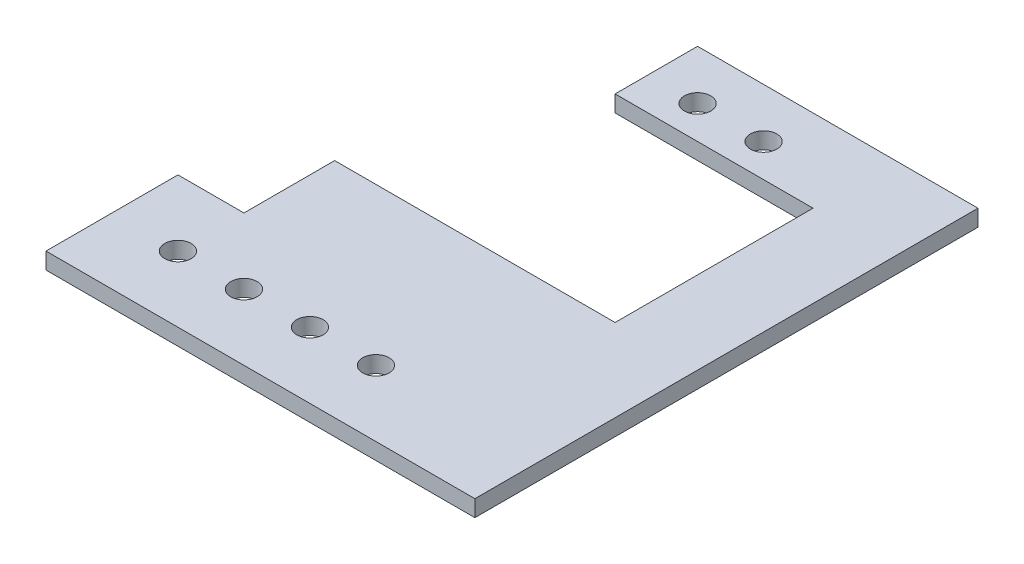
ISO-10303-21;
HEADER;
FILE_DESCRIPTION(('STEP AP214'),'2;1');
FILE_NAME('part.step','',(''),(''),'','','');
FILE_SCHEMA(('AUTOMOTIVE_DESIGN { 1 0 10303 214 1 1 1 1 }'));
ENDSEC;
DATA;
#1=APPLICATION_CONTEXT('core data for automotive mechanical design processes');
#2=APPLICATION_PROTOCOL_DEFINITION('international standard','automotive_design',2000,#1);
#3=PRODUCT_CONTEXT('',#1,'mechanical');
#4=PRODUCT('Part','Part','',(#3));
#5=PRODUCT_RELATED_PRODUCT_CATEGORY('part','',(#4));
#6=PRODUCT_DEFINITION_FORMATION('','',#4);
#7=PRODUCT_DEFINITION_CONTEXT('part definition',#1,'design');
#8=PRODUCT_DEFINITION('design','',#6,#7);
#9=PRODUCT_DEFINITION_SHAPE('','',#8);
#10=(LENGTH_UNIT() NAMED_UNIT(*) SI_UNIT(.MILLI.,.METRE.));
#11=(NAMED_UNIT(*) PLANE_ANGLE_UNIT() SI_UNIT($,.RADIAN.));
#12=(NAMED_UNIT(*) SI_UNIT($,.STERADIAN.) SOLID_ANGLE_UNIT());
#13=UNCERTAINTY_MEASURE_WITH_UNIT(LENGTH_MEASURE(1.E-05),#10,'distance_accuracy_value','');
#14=(GEOMETRIC_REPRESENTATION_CONTEXT(3) GLOBAL_UNCERTAINTY_ASSIGNED_CONTEXT((#13)) GLOBAL_UNIT_ASSIGNED_CONTEXT((#10,
#11,#12)) REPRESENTATION_CONTEXT('',''));
#15=CARTESIAN_POINT('',(0.,0.,0.));
#16=DIRECTION('',(0.,0.,1.));
#17=DIRECTION('',(1.,0.,0.));
#18=AXIS2_PLACEMENT_3D('',#15,#16,#17);
#19=CARTESIAN_POINT('',(0.,-3.175,0.));
#20=DIRECTION('',(-1.,0.,0.));
#21=DIRECTION('',(0.,0.,1.));
#22=AXIS2_PLACEMENT_3D('',#19,#20,#21);
#23=PLANE('',#22);
#24=DIRECTION('',(0.,1.,0.));
#25=VECTOR('',#24,1.);
#26=CARTESIAN_POINT('',(0.,-3.175,-25.4));
#27=LINE('',#26,#25);
#28=CARTESIAN_POINT('',(0.,-3.175,-25.4));
#29=VERTEX_POINT('',#28);
#30=CARTESIAN_POINT('',(0.,0.,-25.4));
#31=VERTEX_POINT('',#30);
#32=EDGE_CURVE('E71',#29,#31,#27,.T.);
#33=ORIENTED_EDGE('',*,*,#32,.F.);
#34=DIRECTION('',(0.,0.,1.));
#35=VECTOR('',#34,1.);
#36=CARTESIAN_POINT('',(0.,-3.175,0.));
#37=LINE('',#36,#35);
#38=CARTESIAN_POINT('',(0.,-3.175,0.));
#39=VERTEX_POINT('',#38);
#40=EDGE_CURVE('E170',#29,#39,#37,.T.);
#41=ORIENTED_EDGE('',*,*,#40,.T.);
#42=DIRECTION('',(0.,1.,0.));
#43=VECTOR('',#42,1.);
#44=CARTESIAN_POINT('',(0.,-3.175,0.));
#45=LINE('',#44,#43);
#46=CARTESIAN_POINT('',(0.,0.,0.));
#47=VERTEX_POINT('',#46);
#48=EDGE_CURVE('E50',#39,#47,#45,.T.);
#49=ORIENTED_EDGE('',*,*,#48,.T.);
#50=DIRECTION('',(0.,0.,1.));
#51=VECTOR('',#50,1.);
#52=CARTESIAN_POINT('',(0.,0.,0.));
#53=LINE('',#52,#51);
#54=EDGE_CURVE('E160',#31,#47,#53,.T.);
#55=ORIENTED_EDGE('',*,*,#54,.F.);
#56=EDGE_LOOP('',(#33,#41,#49,#55));
#57=FACE_BOUND('',#56,.T.);
#58=ADVANCED_FACE('F47',(#57),#23,.T.);
#59=CARTESIAN_POINT('',(0.,-3.175,-96.8375));
#60=DIRECTION('',(0.,0.,-1.));
#61=DIRECTION('',(-1.,0.,0.));
#62=AXIS2_PLACEMENT_3D('',#59,#60,#61);
#63=PLANE('',#62);
#64=DIRECTION('',(0.,1.,0.));
#65=VECTOR('',#64,1.);
#66=CARTESIAN_POINT('',(28.575,-3.175,-96.8375));
#67=LINE('',#66,#65);
#68=CARTESIAN_POINT('',(28.575,-3.175,-96.8375));
#69=VERTEX_POINT('',#68);
#70=CARTESIAN_POINT('',(28.575,0.,-96.8375));
#71=VERTEX_POINT('',#70);
#72=EDGE_CURVE('E126',#69,#71,#67,.T.);
#73=ORIENTED_EDGE('',*,*,#72,.T.);
#74=DIRECTION('',(-1.,0.,0.));
#75=VECTOR('',#74,1.);
#76=CARTESIAN_POINT('',(0.,0.,-96.8375));
#77=LINE('',#76,#75);
#78=CARTESIAN_POINT('',(82.55,0.,-96.8375));
#79=VERTEX_POINT('',#78);
#80=EDGE_CURVE('E169',#79,#71,#77,.T.);
#81=ORIENTED_EDGE('',*,*,#80,.F.);
#82=DIRECTION('',(0.,1.,0.));
#83=VECTOR('',#82,1.);
#84=CARTESIAN_POINT('',(82.55,-3.175,-96.8375));
#85=LINE('',#84,#83);
#86=CARTESIAN_POINT('',(82.55,-3.175,-96.8375));
#87=VERTEX_POINT('',#86);
#88=EDGE_CURVE('E11',#87,#79,#85,.T.);
#89=ORIENTED_EDGE('',*,*,#88,.F.);
#90=DIRECTION('',(-1.,0.,0.));
#91=VECTOR('',#90,1.);
#92=CARTESIAN_POINT('',(0.,-3.175,-96.8375));
#93=LINE('',#92,#91);
#94=EDGE_CURVE('E146',#87,#69,#93,.T.);
#95=ORIENTED_EDGE('',*,*,#94,.T.);
#96=EDGE_LOOP('',(#73,#81,#89,#95));
#97=FACE_BOUND('',#96,.T.);
#98=ADVANCED_FACE('F151',(#97),#63,.T.);
#99=CARTESIAN_POINT('',(82.55,-3.175,0.));
#100=DIRECTION('',(1.,0.,0.));
#101=DIRECTION('',(0.,0.,-1.));
#102=AXIS2_PLACEMENT_3D('',#99,#100,#101);
#103=PLANE('',#102);
#104=DIRECTION('',(0.,0.,-1.));
#105=VECTOR('',#104,1.);
#106=CARTESIAN_POINT('',(82.55,0.,0.));
#107=LINE('',#106,#105);
#108=CARTESIAN_POINT('',(82.55,0.,0.));
#109=VERTEX_POINT('',#108);
#110=EDGE_CURVE('E166',#109,#79,#107,.T.);
#111=ORIENTED_EDGE('',*,*,#110,.F.);
#112=DIRECTION('',(0.,1.,0.));
#113=VECTOR('',#112,1.);
#114=CARTESIAN_POINT('',(82.55,-3.175,0.));
#115=LINE('',#114,#113);
#116=CARTESIAN_POINT('',(82.55,-3.175,0.));
#117=VERTEX_POINT('',#116);
#118=EDGE_CURVE('E55',#117,#109,#115,.T.);
#119=ORIENTED_EDGE('',*,*,#118,.F.);
#120=DIRECTION('',(0.,0.,-1.));
#121=VECTOR('',#120,1.);
#122=CARTESIAN_POINT('',(82.55,-3.175,0.));
#123=LINE('',#122,#121);
#124=EDGE_CURVE('E153',#117,#87,#123,.T.);
#125=ORIENTED_EDGE('',*,*,#124,.T.);
#126=ORIENTED_EDGE('',*,*,#88,.T.);
#127=EDGE_LOOP('',(#111,#119,#125,#126));
#128=FACE_BOUND('',#127,.T.);
#129=ADVANCED_FACE('F179',(#128),#103,.T.);
#130=CARTESIAN_POINT('',(0.,-3.175,0.));
#131=DIRECTION('',(0.,0.,1.));
#132=DIRECTION('',(1.,0.,0.));
#133=AXIS2_PLACEMENT_3D('',#130,#131,#132);
#134=PLANE('',#133);
#135=DIRECTION('',(1.,0.,0.));
#136=VECTOR('',#135,1.);
#137=CARTESIAN_POINT('',(0.,0.,0.));
#138=LINE('',#137,#136);
#139=EDGE_CURVE('E162',#47,#109,#138,.T.);
#140=ORIENTED_EDGE('',*,*,#139,.F.);
#141=ORIENTED_EDGE('',*,*,#48,.F.);
#142=DIRECTION('',(1.,0.,0.));
#143=VECTOR('',#142,1.);
#144=CARTESIAN_POINT('',(0.,-3.175,0.));
#145=LINE('',#144,#143);
#146=EDGE_CURVE('E156',#39,#117,#145,.T.);
#147=ORIENTED_EDGE('',*,*,#146,.T.);
#148=ORIENTED_EDGE('',*,*,#118,.T.);
#149=EDGE_LOOP('',(#140,#141,#147,#148));
#150=FACE_BOUND('',#149,.T.);
#151=ADVANCED_FACE('F175',(#150),#134,.T.);
#152=CARTESIAN_POINT('',(0.,-3.175,0.));
#153=DIRECTION('',(0.,-1.,0.));
#154=DIRECTION('',(0.,0.,-1.));
#155=AXIS2_PLACEMENT_3D('',#152,#153,#154);
#156=PLANE('',#155);
#157=CARTESIAN_POINT('',(38.1,-3.175,-87.3125));
#158=DIRECTION('',(0.,1.,0.));
#159=DIRECTION('',(0.,0.,1.));
#160=AXIS2_PLACEMENT_3D('',#157,#158,#159);
#161=CIRCLE('',#160,2.54);
#162=CARTESIAN_POINT('',(38.1,-3.175,-84.7725));
#163=VERTEX_POINT('',#162);
#164=EDGE_CURVE('E244',#163,#163,#161,.T.);
#165=ORIENTED_EDGE('',*,*,#164,.T.);
#166=EDGE_LOOP('',(#165));
#167=FACE_BOUND('',#166,.T.);
#168=CARTESIAN_POINT('',(50.8,-3.175,-87.3125));
#169=DIRECTION('',(0.,1.,0.));
#170=DIRECTION('',(0.,0.,1.));
#171=AXIS2_PLACEMENT_3D('',#168,#169,#170);
#172=CIRCLE('',#171,2.54);
#173=CARTESIAN_POINT('',(50.8,-3.175,-84.7725));
#174=VERTEX_POINT('',#173);
#175=EDGE_CURVE('E246',#174,#174,#172,.T.);
#176=ORIENTED_EDGE('',*,*,#175,.T.);
#177=EDGE_LOOP('',(#176));
#178=FACE_BOUND('',#177,.T.);
#179=DIRECTION('',(0.,0.,-1.));
#180=VECTOR('',#179,1.);
#181=CARTESIAN_POINT('',(28.575,-3.175,-42.8625));
#182=LINE('',#181,#180);
#183=CARTESIAN_POINT('',(28.575,-3.175,-80.9625));
#184=VERTEX_POINT('',#183);
#185=EDGE_CURVE('E129',#184,#69,#182,.T.);
#186=ORIENTED_EDGE('',*,*,#185,.T.);
#187=ORIENTED_EDGE('',*,*,#94,.F.);
#188=ORIENTED_EDGE('',*,*,#124,.F.);
#189=ORIENTED_EDGE('',*,*,#146,.F.);
#190=ORIENTED_EDGE('',*,*,#40,.F.);
#191=DIRECTION('',(1.,0.,0.));
#192=VECTOR('',#191,1.);
#193=CARTESIAN_POINT('',(0.,-3.175,-25.4));
#194=LINE('',#193,#192);
#195=CARTESIAN_POINT('',(12.7,-3.175,-25.4));
#196=VERTEX_POINT('',#195);
#197=EDGE_CURVE('E215',#29,#196,#194,.T.);
#198=ORIENTED_EDGE('',*,*,#197,.T.);
#199=DIRECTION('',(0.,0.,-1.));
#200=VECTOR('',#199,1.);
#201=CARTESIAN_POINT('',(12.7,-3.175,-96.8375));
#202=LINE('',#201,#200);
#203=CARTESIAN_POINT('',(12.7,-3.175,-42.8625));
#204=VERTEX_POINT('',#203);
#205=EDGE_CURVE('E210',#196,#204,#202,.T.);
#206=ORIENTED_EDGE('',*,*,#205,.T.);
#207=DIRECTION('',(1.,0.,0.));
#208=VECTOR('',#207,1.);
#209=CARTESIAN_POINT('',(28.575,-3.175,-42.8625));
#210=LINE('',#209,#208);
#211=CARTESIAN_POINT('',(66.675,-3.175,-42.8625));
#212=VERTEX_POINT('',#211);
#213=EDGE_CURVE('E63',#204,#212,#210,.T.);
#214=ORIENTED_EDGE('',*,*,#213,.T.);
#215=DIRECTION('',(0.,0.,-1.));
#216=VECTOR('',#215,1.);
#217=CARTESIAN_POINT('',(66.675,-3.175,-42.8625));
#218=LINE('',#217,#216);
#219=CARTESIAN_POINT('',(66.675,-3.175,-80.9625));
#220=VERTEX_POINT('',#219);
#221=EDGE_CURVE('E206',#212,#220,#218,.T.);
#222=ORIENTED_EDGE('',*,*,#221,.T.);
#223=DIRECTION('',(-1.,0.,0.));
#224=VECTOR('',#223,1.);
#225=CARTESIAN_POINT('',(28.575,-3.175,-80.9625));
#226=LINE('',#225,#224);
#227=EDGE_CURVE('E149',#220,#184,#226,.T.);
#228=ORIENTED_EDGE('',*,*,#227,.T.);
#229=EDGE_LOOP('',(#186,#187,#188,#189,#190,#198,#206,#214,#222,#228));
#230=FACE_BOUND('',#229,.T.);
#231=CARTESIAN_POINT('',(12.7,-3.175,-12.7));
#232=DIRECTION('',(0.,1.,0.));
#233=DIRECTION('',(0.,0.,1.));
#234=AXIS2_PLACEMENT_3D('',#231,#232,#233);
#235=CIRCLE('',#234,2.54);
#236=CARTESIAN_POINT('',(12.7,-3.175,-10.16));
#237=VERTEX_POINT('',#236);
#238=EDGE_CURVE('E217',#237,#237,#235,.T.);
#239=ORIENTED_EDGE('',*,*,#238,.T.);
#240=EDGE_LOOP('',(#239));
#241=FACE_BOUND('',#240,.T.);
#242=CARTESIAN_POINT('',(25.4,-3.175,-12.7));
#243=DIRECTION('',(0.,1.,0.));
#244=DIRECTION('',(0.,0.,1.));
#245=AXIS2_PLACEMENT_3D('',#242,#243,#244);
#246=CIRCLE('',#245,2.54);
#247=CARTESIAN_POINT('',(25.4,-3.175,-10.16));
#248=VERTEX_POINT('',#247);
#249=EDGE_CURVE('E232',#248,#248,#246,.T.);
#250=ORIENTED_EDGE('',*,*,#249,.T.);
#251=EDGE_LOOP('',(#250));
#252=FACE_BOUND('',#251,.T.);
#253=CARTESIAN_POINT('',(38.1,-3.175,-12.7));
#254=DIRECTION('',(0.,1.,0.));
#255=DIRECTION('',(0.,0.,1.));
#256=AXIS2_PLACEMENT_3D('',#253,#254,#255);
#257=CIRCLE('',#256,2.54);
#258=CARTESIAN_POINT('',(38.1,-3.175,-10.16));
#259=VERTEX_POINT('',#258);
#260=EDGE_CURVE('E226',#259,#259,#257,.T.);
#261=ORIENTED_EDGE('',*,*,#260,.T.);
#262=EDGE_LOOP('',(#261));
#263=FACE_BOUND('',#262,.T.);
#264=CARTESIAN_POINT('',(50.8,-3.175,-12.7));
#265=DIRECTION('',(0.,1.,0.));
#266=DIRECTION('',(0.,0.,1.));
#267=AXIS2_PLACEMENT_3D('',#264,#265,#266);
#268=CIRCLE('',#267,2.54);
#269=CARTESIAN_POINT('',(50.8,-3.175,-10.16));
#270=VERTEX_POINT('',#269);
#271=EDGE_CURVE('E137',#270,#270,#268,.T.);
#272=ORIENTED_EDGE('',*,*,#271,.T.);
#273=EDGE_LOOP('',(#272));
#274=FACE_BOUND('',#273,.T.);
#275=ADVANCED_FACE('F143',(#167,#178,#230,#241,#252,#263,#274),#156,.T.);
#276=CARTESIAN_POINT('',(0.,0.,0.));
#277=DIRECTION('',(0.,-1.,0.));
#278=DIRECTION('',(0.,0.,-1.));
#279=AXIS2_PLACEMENT_3D('',#276,#277,#278);
#280=PLANE('',#279);
#281=CARTESIAN_POINT('',(38.1,0.,-87.3125));
#282=DIRECTION('',(0.,1.,0.));
#283=DIRECTION('',(0.,0.,1.));
#284=AXIS2_PLACEMENT_3D('',#281,#282,#283);
#285=CIRCLE('',#284,2.54);
#286=CARTESIAN_POINT('',(38.1,0.,-84.7725));
#287=VERTEX_POINT('',#286);
#288=EDGE_CURVE('E252',#287,#287,#285,.T.);
#289=ORIENTED_EDGE('',*,*,#288,.F.);
#290=EDGE_LOOP('',(#289));
#291=FACE_BOUND('',#290,.T.);
#292=CARTESIAN_POINT('',(50.8,0.,-87.3125));
#293=DIRECTION('',(0.,1.,0.));
#294=DIRECTION('',(0.,0.,1.));
#295=AXIS2_PLACEMENT_3D('',#292,#293,#294);
#296=CIRCLE('',#295,2.54);
#297=CARTESIAN_POINT('',(50.8,0.,-84.7725));
#298=VERTEX_POINT('',#297);
#299=EDGE_CURVE('E249',#298,#298,#296,.T.);
#300=ORIENTED_EDGE('',*,*,#299,.F.);
#301=EDGE_LOOP('',(#300));
#302=FACE_BOUND('',#301,.T.);
#303=CARTESIAN_POINT('',(12.7,0.,-12.7));
#304=DIRECTION('',(0.,1.,0.));
#305=DIRECTION('',(0.,0.,1.));
#306=AXIS2_PLACEMENT_3D('',#303,#304,#305);
#307=CIRCLE('',#306,2.54);
#308=CARTESIAN_POINT('',(12.7,0.,-10.16));
#309=VERTEX_POINT('',#308);
#310=EDGE_CURVE('E238',#309,#309,#307,.T.);
#311=ORIENTED_EDGE('',*,*,#310,.F.);
#312=EDGE_LOOP('',(#311));
#313=FACE_BOUND('',#312,.T.);
#314=CARTESIAN_POINT('',(25.4,0.,-12.7));
#315=DIRECTION('',(0.,1.,0.));
#316=DIRECTION('',(0.,0.,1.));
#317=AXIS2_PLACEMENT_3D('',#314,#315,#316);
#318=CIRCLE('',#317,2.54);
#319=CARTESIAN_POINT('',(25.4,0.,-10.16));
#320=VERTEX_POINT('',#319);
#321=EDGE_CURVE('E235',#320,#320,#318,.T.);
#322=ORIENTED_EDGE('',*,*,#321,.F.);
#323=EDGE_LOOP('',(#322));
#324=FACE_BOUND('',#323,.T.);
#325=CARTESIAN_POINT('',(38.1,0.,-12.7));
#326=DIRECTION('',(0.,1.,0.));
#327=DIRECTION('',(0.,0.,1.));
#328=AXIS2_PLACEMENT_3D('',#325,#326,#327);
#329=CIRCLE('',#328,2.54);
#330=CARTESIAN_POINT('',(38.1,0.,-10.16));
#331=VERTEX_POINT('',#330);
#332=EDGE_CURVE('E229',#331,#331,#329,.T.);
#333=ORIENTED_EDGE('',*,*,#332,.F.);
#334=EDGE_LOOP('',(#333));
#335=FACE_BOUND('',#334,.T.);
#336=CARTESIAN_POINT('',(50.8,0.,-12.7));
#337=DIRECTION('',(0.,1.,0.));
#338=DIRECTION('',(0.,0.,1.));
#339=AXIS2_PLACEMENT_3D('',#336,#337,#338);
#340=CIRCLE('',#339,2.54);
#341=CARTESIAN_POINT('',(50.8,0.,-10.16));
#342=VERTEX_POINT('',#341);
#343=EDGE_CURVE('E223',#342,#342,#340,.T.);
#344=ORIENTED_EDGE('',*,*,#343,.F.);
#345=EDGE_LOOP('',(#344));
#346=FACE_BOUND('',#345,.T.);
#347=ORIENTED_EDGE('',*,*,#80,.T.);
#348=DIRECTION('',(0.,0.,-1.));
#349=VECTOR('',#348,1.);
#350=CARTESIAN_POINT('',(28.575,0.,-42.8625));
#351=LINE('',#350,#349);
#352=CARTESIAN_POINT('',(28.575,0.,-80.9625));
#353=VERTEX_POINT('',#352);
#354=EDGE_CURVE('E132',#353,#71,#351,.T.);
#355=ORIENTED_EDGE('',*,*,#354,.F.);
#356=DIRECTION('',(-1.,0.,0.));
#357=VECTOR('',#356,1.);
#358=CARTESIAN_POINT('',(28.575,0.,-80.9625));
#359=LINE('',#358,#357);
#360=CARTESIAN_POINT('',(66.675,0.,-80.9625));
#361=VERTEX_POINT('',#360);
#362=EDGE_CURVE('E195',#361,#353,#359,.T.);
#363=ORIENTED_EDGE('',*,*,#362,.F.);
#364=DIRECTION('',(0.,0.,-1.));
#365=VECTOR('',#364,1.);
#366=CARTESIAN_POINT('',(66.675,0.,-42.8625));
#367=LINE('',#366,#365);
#368=CARTESIAN_POINT('',(66.675,0.,-42.8625));
#369=VERTEX_POINT('',#368);
#370=EDGE_CURVE('E198',#369,#361,#367,.T.);
#371=ORIENTED_EDGE('',*,*,#370,.F.);
#372=DIRECTION('',(1.,0.,0.));
#373=VECTOR('',#372,1.);
#374=CARTESIAN_POINT('',(28.575,0.,-42.8625));
#375=LINE('',#374,#373);
#376=CARTESIAN_POINT('',(12.7,0.,-42.8625));
#377=VERTEX_POINT('',#376);
#378=EDGE_CURVE('E201',#377,#369,#375,.T.);
#379=ORIENTED_EDGE('',*,*,#378,.F.);
#380=DIRECTION('',(0.,0.,-1.));
#381=VECTOR('',#380,1.);
#382=CARTESIAN_POINT('',(12.7,0.,-96.8375));
#383=LINE('',#382,#381);
#384=CARTESIAN_POINT('',(12.7,0.,-25.4));
#385=VERTEX_POINT('',#384);
#386=EDGE_CURVE('E212',#385,#377,#383,.T.);
#387=ORIENTED_EDGE('',*,*,#386,.F.);
#388=DIRECTION('',(1.,0.,0.));
#389=VECTOR('',#388,1.);
#390=CARTESIAN_POINT('',(0.,0.,-25.4));
#391=LINE('',#390,#389);
#392=EDGE_CURVE('E184',#31,#385,#391,.T.);
#393=ORIENTED_EDGE('',*,*,#392,.F.);
#394=ORIENTED_EDGE('',*,*,#54,.T.);
#395=ORIENTED_EDGE('',*,*,#139,.T.);
#396=ORIENTED_EDGE('',*,*,#110,.T.);
#397=EDGE_LOOP('',(#347,#355,#363,#371,#379,#387,#393,#394,#395,#396));
#398=FACE_BOUND('',#397,.T.);
#399=ADVANCED_FACE('F181',(#291,#302,#313,#324,#335,#346,#398),#280,.F.);
#400=CARTESIAN_POINT('',(28.575,-3.175,-80.9625));
#401=DIRECTION('',(0.,0.,-1.));
#402=DIRECTION('',(-1.,0.,0.));
#403=AXIS2_PLACEMENT_3D('',#400,#401,#402);
#404=PLANE('',#403);
#405=ORIENTED_EDGE('',*,*,#362,.T.);
#406=DIRECTION('',(0.,1.,0.));
#407=VECTOR('',#406,1.);
#408=CARTESIAN_POINT('',(28.575,-3.175,-80.9625));
#409=LINE('',#408,#407);
#410=EDGE_CURVE('E163',#184,#353,#409,.T.);
#411=ORIENTED_EDGE('',*,*,#410,.F.);
#412=ORIENTED_EDGE('',*,*,#227,.F.);
#413=DIRECTION('',(0.,1.,0.));
#414=VECTOR('',#413,1.);
#415=CARTESIAN_POINT('',(66.675,-3.175,-80.9625));
#416=LINE('',#415,#414);
#417=EDGE_CURVE('E192',#220,#361,#416,.T.);
#418=ORIENTED_EDGE('',*,*,#417,.T.);
#419=EDGE_LOOP('',(#405,#411,#412,#418));
#420=FACE_BOUND('',#419,.T.);
#421=ADVANCED_FACE('F269',(#420),#404,.F.);
#422=CARTESIAN_POINT('',(66.675,-3.175,-42.8625));
#423=DIRECTION('',(1.,0.,0.));
#424=DIRECTION('',(0.,0.,-1.));
#425=AXIS2_PLACEMENT_3D('',#422,#423,#424);
#426=PLANE('',#425);
#427=ORIENTED_EDGE('',*,*,#370,.T.);
#428=ORIENTED_EDGE('',*,*,#417,.F.);
#429=ORIENTED_EDGE('',*,*,#221,.F.);
#430=DIRECTION('',(0.,1.,0.));
#431=VECTOR('',#430,1.);
#432=CARTESIAN_POINT('',(66.675,-3.175,-42.8625));
#433=LINE('',#432,#431);
#434=EDGE_CURVE('E190',#212,#369,#433,.T.);
#435=ORIENTED_EDGE('',*,*,#434,.T.);
#436=EDGE_LOOP('',(#427,#428,#429,#435));
#437=FACE_BOUND('',#436,.T.);
#438=ADVANCED_FACE('F322',(#437),#426,.F.);
#439=CARTESIAN_POINT('',(28.575,-3.175,-42.8625));
#440=DIRECTION('',(0.,0.,1.));
#441=DIRECTION('',(1.,0.,0.));
#442=AXIS2_PLACEMENT_3D('',#439,#440,#441);
#443=PLANE('',#442);
#444=ORIENTED_EDGE('',*,*,#378,.T.);
#445=ORIENTED_EDGE('',*,*,#434,.F.);
#446=ORIENTED_EDGE('',*,*,#213,.F.);
#447=DIRECTION('',(0.,1.,0.));
#448=VECTOR('',#447,1.);
#449=CARTESIAN_POINT('',(12.7,-3.175,-42.8625));
#450=LINE('',#449,#448);
#451=EDGE_CURVE('E138',#204,#377,#450,.T.);
#452=ORIENTED_EDGE('',*,*,#451,.T.);
#453=EDGE_LOOP('',(#444,#445,#446,#452));
#454=FACE_BOUND('',#453,.T.);
#455=ADVANCED_FACE('F319',(#454),#443,.F.);
#456=CARTESIAN_POINT('',(12.7,-3.175,-96.8375));
#457=DIRECTION('',(1.,0.,0.));
#458=DIRECTION('',(0.,0.,-1.));
#459=AXIS2_PLACEMENT_3D('',#456,#457,#458);
#460=PLANE('',#459);
#461=ORIENTED_EDGE('',*,*,#386,.T.);
#462=ORIENTED_EDGE('',*,*,#451,.F.);
#463=ORIENTED_EDGE('',*,*,#205,.F.);
#464=DIRECTION('',(0.,1.,0.));
#465=VECTOR('',#464,1.);
#466=CARTESIAN_POINT('',(12.7,-3.175,-25.4));
#467=LINE('',#466,#465);
#468=EDGE_CURVE('E204',#196,#385,#467,.T.);
#469=ORIENTED_EDGE('',*,*,#468,.T.);
#470=EDGE_LOOP('',(#461,#462,#463,#469));
#471=FACE_BOUND('',#470,.T.);
#472=ADVANCED_FACE('F294',(#471),#460,.F.);
#473=CARTESIAN_POINT('',(0.,-3.175,-25.4));
#474=DIRECTION('',(0.,0.,1.));
#475=DIRECTION('',(1.,0.,0.));
#476=AXIS2_PLACEMENT_3D('',#473,#474,#475);
#477=PLANE('',#476);
#478=ORIENTED_EDGE('',*,*,#392,.T.);
#479=ORIENTED_EDGE('',*,*,#468,.F.);
#480=ORIENTED_EDGE('',*,*,#197,.F.);
#481=ORIENTED_EDGE('',*,*,#32,.T.);
#482=EDGE_LOOP('',(#478,#479,#480,#481));
#483=FACE_BOUND('',#482,.T.);
#484=ADVANCED_FACE('F284',(#483),#477,.F.);
#485=CARTESIAN_POINT('',(50.8,-3.175,-12.7));
#486=DIRECTION('',(0.,1.,0.));
#487=DIRECTION('',(0.,0.,1.));
#488=AXIS2_PLACEMENT_3D('',#485,#486,#487);
#489=CYLINDRICAL_SURFACE('',#488,2.54);
#490=ORIENTED_EDGE('',*,*,#271,.F.);
#491=EDGE_LOOP('',(#490));
#492=FACE_BOUND('',#491,.T.);
#493=ORIENTED_EDGE('',*,*,#343,.T.);
#494=EDGE_LOOP('',(#493));
#495=FACE_BOUND('',#494,.T.);
#496=ADVANCED_FACE('F281',(#492,#495),#489,.F.);
#497=CARTESIAN_POINT('',(38.1,-3.175,-12.7));
#498=DIRECTION('',(0.,1.,0.));
#499=DIRECTION('',(0.,0.,1.));
#500=AXIS2_PLACEMENT_3D('',#497,#498,#499);
#501=CYLINDRICAL_SURFACE('',#500,2.54);
#502=ORIENTED_EDGE('',*,*,#260,.F.);
#503=EDGE_LOOP('',(#502));
#504=FACE_BOUND('',#503,.T.);
#505=ORIENTED_EDGE('',*,*,#332,.T.);
#506=EDGE_LOOP('',(#505));
#507=FACE_BOUND('',#506,.T.);
#508=ADVANCED_FACE('F283',(#504,#507),#501,.F.);
#509=CARTESIAN_POINT('',(25.4,-3.175,-12.7));
#510=DIRECTION('',(0.,1.,0.));
#511=DIRECTION('',(0.,0.,1.));
#512=AXIS2_PLACEMENT_3D('',#509,#510,#511);
#513=CYLINDRICAL_SURFACE('',#512,2.54);
#514=ORIENTED_EDGE('',*,*,#249,.F.);
#515=EDGE_LOOP('',(#514));
#516=FACE_BOUND('',#515,.T.);
#517=ORIENTED_EDGE('',*,*,#321,.T.);
#518=EDGE_LOOP('',(#517));
#519=FACE_BOUND('',#518,.T.);
#520=ADVANCED_FACE('F291',(#516,#519),#513,.F.);
#521=CARTESIAN_POINT('',(12.7,-3.175,-12.7));
#522=DIRECTION('',(0.,1.,0.));
#523=DIRECTION('',(0.,0.,1.));
#524=AXIS2_PLACEMENT_3D('',#521,#522,#523);
#525=CYLINDRICAL_SURFACE('',#524,2.54);
#526=ORIENTED_EDGE('',*,*,#238,.F.);
#527=EDGE_LOOP('',(#526));
#528=FACE_BOUND('',#527,.T.);
#529=ORIENTED_EDGE('',*,*,#310,.T.);
#530=EDGE_LOOP('',(#529));
#531=FACE_BOUND('',#530,.T.);
#532=ADVANCED_FACE('F342',(#528,#531),#525,.F.);
#533=CARTESIAN_POINT('',(28.575,-3.175,-42.8625));
#534=DIRECTION('',(1.,0.,0.));
#535=DIRECTION('',(0.,0.,-1.));
#536=AXIS2_PLACEMENT_3D('',#533,#534,#535);
#537=PLANE('',#536);
#538=ORIENTED_EDGE('',*,*,#354,.T.);
#539=ORIENTED_EDGE('',*,*,#72,.F.);
#540=ORIENTED_EDGE('',*,*,#185,.F.);
#541=ORIENTED_EDGE('',*,*,#410,.T.);
#542=EDGE_LOOP('',(#538,#539,#540,#541));
#543=FACE_BOUND('',#542,.T.);
#544=ADVANCED_FACE('F128',(#543),#537,.F.);
#545=CARTESIAN_POINT('',(50.8,-3.175,-87.3125));
#546=DIRECTION('',(0.,1.,0.));
#547=DIRECTION('',(0.,0.,1.));
#548=AXIS2_PLACEMENT_3D('',#545,#546,#547);
#549=CYLINDRICAL_SURFACE('',#548,2.54);
#550=ORIENTED_EDGE('',*,*,#175,.F.);
#551=EDGE_LOOP('',(#550));
#552=FACE_BOUND('',#551,.T.);
#553=ORIENTED_EDGE('',*,*,#299,.T.);
#554=EDGE_LOOP('',(#553));
#555=FACE_BOUND('',#554,.T.);
#556=ADVANCED_FACE('F263',(#552,#555),#549,.F.);
#557=CARTESIAN_POINT('',(38.1,-3.175,-87.3125));
#558=DIRECTION('',(0.,1.,0.));
#559=DIRECTION('',(0.,0.,1.));
#560=AXIS2_PLACEMENT_3D('',#557,#558,#559);
#561=CYLINDRICAL_SURFACE('',#560,2.54);
#562=ORIENTED_EDGE('',*,*,#164,.F.);
#563=EDGE_LOOP('',(#562));
#564=FACE_BOUND('',#563,.T.);
#565=ORIENTED_EDGE('',*,*,#288,.T.);
#566=EDGE_LOOP('',(#565));
#567=FACE_BOUND('',#566,.T.);
#568=ADVANCED_FACE('F260',(#564,#567),#561,.F.);
#569=CLOSED_SHELL('',(#58,#98,#129,#151,#275,#399,#421,#438,#455,#472,#484,#496,#508,#520,#532,
#544,#556,#568));
#570=MANIFOLD_SOLID_BREP('B2',#569);
#571=ADVANCED_BREP_SHAPE_REPRESENTATION('',(#18,#570),#14);
#572=SHAPE_DEFINITION_REPRESENTATION(#9,#571);
ENDSEC;
END-ISO-10303-21;
